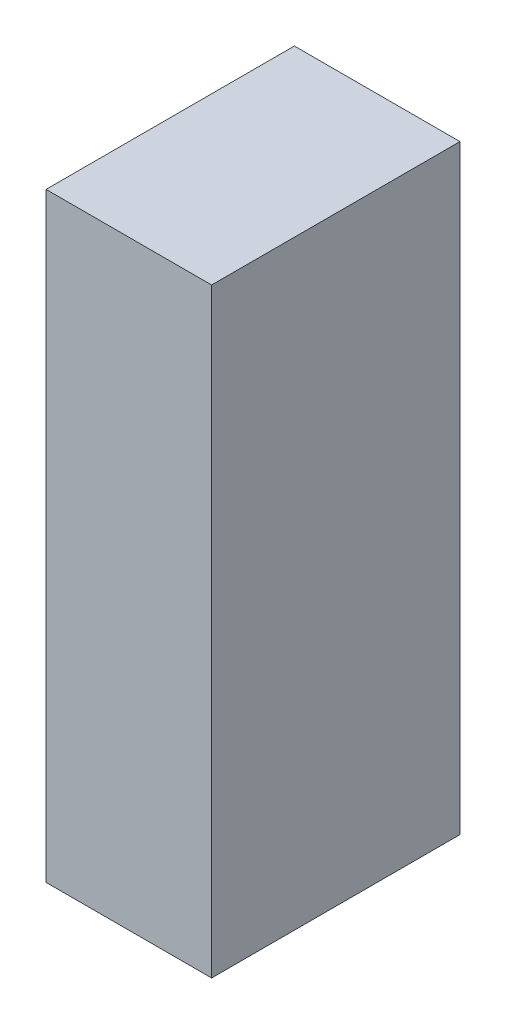
ISO-10303-21;
HEADER;
FILE_DESCRIPTION(('STEP AP214'),'2;1');
FILE_NAME('part.step','',(''),(''),'','','');
FILE_SCHEMA(('AUTOMOTIVE_DESIGN { 1 0 10303 214 1 1 1 1 }'));
ENDSEC;
DATA;
#1=APPLICATION_CONTEXT('core data for automotive mechanical design processes');
#2=APPLICATION_PROTOCOL_DEFINITION('international standard','automotive_design',2000,#1);
#3=PRODUCT_CONTEXT('',#1,'mechanical');
#4=PRODUCT('Part','Part','',(#3));
#5=PRODUCT_RELATED_PRODUCT_CATEGORY('part','',(#4));
#6=PRODUCT_DEFINITION_FORMATION('','',#4);
#7=PRODUCT_DEFINITION_CONTEXT('part definition',#1,'design');
#8=PRODUCT_DEFINITION('design','',#6,#7);
#9=PRODUCT_DEFINITION_SHAPE('','',#8);
#10=(LENGTH_UNIT() NAMED_UNIT(*) SI_UNIT(.MILLI.,.METRE.));
#11=(NAMED_UNIT(*) PLANE_ANGLE_UNIT() SI_UNIT($,.RADIAN.));
#12=(NAMED_UNIT(*) SI_UNIT($,.STERADIAN.) SOLID_ANGLE_UNIT());
#13=UNCERTAINTY_MEASURE_WITH_UNIT(LENGTH_MEASURE(1.E-05),#10,'distance_accuracy_value','');
#14=(GEOMETRIC_REPRESENTATION_CONTEXT(3) GLOBAL_UNCERTAINTY_ASSIGNED_CONTEXT((#13)) GLOBAL_UNIT_ASSIGNED_CONTEXT((#10,
#11,#12)) REPRESENTATION_CONTEXT('',''));
#15=CARTESIAN_POINT('',(0.,0.,0.));
#16=DIRECTION('',(0.,0.,1.));
#17=DIRECTION('',(1.,0.,0.));
#18=AXIS2_PLACEMENT_3D('',#15,#16,#17);
#19=CARTESIAN_POINT('',(-1.09999353711135,0.725001968418042,0.));
#20=DIRECTION('',(-1.,4.37113882867379E-08,0.));
#21=DIRECTION('',(-4.37113882867379E-08,-1.,0.));
#22=AXIS2_PLACEMENT_3D('',#19,#20,#21);
#23=PLANE('',#22);
#24=DIRECTION('',(-4.37113882164523E-08,-0.999999999999999,0.));
#25=VECTOR('',#24,1.);
#26=CARTESIAN_POINT('',(-1.09999353711135,0.725001968418042,0.));
#27=LINE('',#26,#25);
#28=CARTESIAN_POINT('',(-1.09999353711135,0.725001968418042,0.));
#29=VERTEX_POINT('',#28);
#30=CARTESIAN_POINT('',(-1.09999360049339,-0.725010238613209,0.));
#31=VERTEX_POINT('',#30);
#32=EDGE_CURVE('E11',#29,#31,#27,.T.);
#33=ORIENTED_EDGE('',*,*,#32,.T.);
#34=DIRECTION('',(0.,0.,1.));
#35=VECTOR('',#34,1.);
#36=CARTESIAN_POINT('',(-1.09999360049339,-0.725010238613209,0.));
#37=LINE('',#36,#35);
#38=CARTESIAN_POINT('',(-1.09999360049339,-0.725010238613209,0.599998772144318));
#39=VERTEX_POINT('',#38);
#40=EDGE_CURVE('E88',#31,#39,#37,.T.);
#41=ORIENTED_EDGE('',*,*,#40,.T.);
#42=DIRECTION('',(-4.37113882164523E-08,-0.999999999999999,0.));
#43=VECTOR('',#42,1.);
#44=CARTESIAN_POINT('',(-1.09999353711135,0.725001968418042,0.599998772144318));
#45=LINE('',#44,#43);
#46=CARTESIAN_POINT('',(-1.09999353711135,0.725001968418042,0.599998772144318));
#47=VERTEX_POINT('',#46);
#48=EDGE_CURVE('E83',#47,#39,#45,.T.);
#49=ORIENTED_EDGE('',*,*,#48,.F.);
#50=DIRECTION('',(0.,0.,1.));
#51=VECTOR('',#50,1.);
#52=CARTESIAN_POINT('',(-1.09999353711135,0.725001968418033,0.));
#53=LINE('',#52,#51);
#54=EDGE_CURVE('E72',#29,#47,#53,.T.);
#55=ORIENTED_EDGE('',*,*,#54,.F.);
#56=EDGE_LOOP('',(#33,#41,#49,#55));
#57=FACE_BOUND('',#56,.T.);
#58=ADVANCED_FACE('F17',(#57),#23,.T.);
#59=CARTESIAN_POINT('',(-1.09999360049339,-0.725010238613209,0.));
#60=DIRECTION('',(-4.37113882867379E-08,-1.,0.));
#61=DIRECTION('',(1.,-4.37113882867379E-08,0.));
#62=AXIS2_PLACEMENT_3D('',#59,#60,#61);
#63=PLANE('',#62);
#64=DIRECTION('',(0.999999999999999,-4.37113884141336E-08,0.));
#65=VECTOR('',#64,1.);
#66=CARTESIAN_POINT('',(-1.09999360049339,-0.725010238613209,0.));
#67=LINE('',#66,#65);
#68=CARTESIAN_POINT('',(-0.699999704009016,-0.725010256097505,0.));
#69=VERTEX_POINT('',#68);
#70=EDGE_CURVE('E24',#31,#69,#67,.T.);
#71=ORIENTED_EDGE('',*,*,#70,.T.);
#72=DIRECTION('',(0.,0.,1.));
#73=VECTOR('',#72,1.);
#74=CARTESIAN_POINT('',(-0.699999704009016,-0.725010256097497,0.));
#75=LINE('',#74,#73);
#76=CARTESIAN_POINT('',(-0.699999704009016,-0.725010256097505,0.599998772144318));
#77=VERTEX_POINT('',#76);
#78=EDGE_CURVE('E85',#69,#77,#75,.T.);
#79=ORIENTED_EDGE('',*,*,#78,.T.);
#80=DIRECTION('',(0.999999999999999,-4.37113884141336E-08,0.));
#81=VECTOR('',#80,1.);
#82=CARTESIAN_POINT('',(-1.09999360049339,-0.725010238613209,0.599998772144318));
#83=LINE('',#82,#81);
#84=EDGE_CURVE('E66',#39,#77,#83,.T.);
#85=ORIENTED_EDGE('',*,*,#84,.F.);
#86=ORIENTED_EDGE('',*,*,#40,.F.);
#87=EDGE_LOOP('',(#71,#79,#85,#86));
#88=FACE_BOUND('',#87,.T.);
#89=ADVANCED_FACE('F89',(#88),#63,.T.);
#90=CARTESIAN_POINT('',(-0.699999704009016,-0.725010256097505,0.));
#91=DIRECTION('',(1.,-4.37113882867379E-08,0.));
#92=DIRECTION('',(4.37113882867379E-08,1.,0.));
#93=AXIS2_PLACEMENT_3D('',#90,#91,#92);
#94=PLANE('',#93);
#95=DIRECTION('',(4.37113882930187E-08,0.999999999999999,0.));
#96=VECTOR('',#95,1.);
#97=CARTESIAN_POINT('',(-0.699999704009016,-0.725010256097505,0.));
#98=LINE('',#97,#96);
#99=CARTESIAN_POINT('',(-0.69999964062697,0.725001950933745,0.));
#100=VERTEX_POINT('',#99);
#101=EDGE_CURVE('E62',#69,#100,#98,.T.);
#102=ORIENTED_EDGE('',*,*,#101,.T.);
#103=DIRECTION('',(0.,0.,1.));
#104=VECTOR('',#103,1.);
#105=CARTESIAN_POINT('',(-0.69999964062697,0.725001950933745,0.));
#106=LINE('',#105,#104);
#107=CARTESIAN_POINT('',(-0.69999964062697,0.725001950933745,0.599998772144318));
#108=VERTEX_POINT('',#107);
#109=EDGE_CURVE('E55',#100,#108,#106,.T.);
#110=ORIENTED_EDGE('',*,*,#109,.T.);
#111=DIRECTION('',(4.37113882930187E-08,0.999999999999999,0.));
#112=VECTOR('',#111,1.);
#113=CARTESIAN_POINT('',(-0.699999704009016,-0.725010256097505,0.599998772144318));
#114=LINE('',#113,#112);
#115=EDGE_CURVE('E59',#77,#108,#114,.T.);
#116=ORIENTED_EDGE('',*,*,#115,.F.);
#117=ORIENTED_EDGE('',*,*,#78,.F.);
#118=EDGE_LOOP('',(#102,#110,#116,#117));
#119=FACE_BOUND('',#118,.T.);
#120=ADVANCED_FACE('F57',(#119),#94,.T.);
#121=CARTESIAN_POINT('',(-0.69999964062697,0.725001950933745,0.));
#122=DIRECTION('',(4.37113882867379E-08,1.,0.));
#123=DIRECTION('',(-1.,4.37113882867379E-08,0.));
#124=AXIS2_PLACEMENT_3D('',#121,#122,#123);
#125=PLANE('',#124);
#126=DIRECTION('',(-0.999999999999999,4.37113884141336E-08,0.));
#127=VECTOR('',#126,1.);
#128=CARTESIAN_POINT('',(-0.69999964062697,0.725001950933745,0.));
#129=LINE('',#128,#127);
#130=EDGE_CURVE('E65',#100,#29,#129,.T.);
#131=ORIENTED_EDGE('',*,*,#130,.T.);
#132=ORIENTED_EDGE('',*,*,#54,.T.);
#133=DIRECTION('',(-0.999999999999999,4.37113884141336E-08,0.));
#134=VECTOR('',#133,1.);
#135=CARTESIAN_POINT('',(-0.69999964062697,0.725001950933745,0.599998772144318));
#136=LINE('',#135,#134);
#137=EDGE_CURVE('E70',#108,#47,#136,.T.);
#138=ORIENTED_EDGE('',*,*,#137,.F.);
#139=ORIENTED_EDGE('',*,*,#109,.F.);
#140=EDGE_LOOP('',(#131,#132,#138,#139));
#141=FACE_BOUND('',#140,.T.);
#142=ADVANCED_FACE('F71',(#141),#125,.T.);
#143=CARTESIAN_POINT('',(-95.6999816894531,411.399993896484,0.599998772144318));
#144=DIRECTION('',(0.,0.,1.));
#145=DIRECTION('',(-4.37113882867379E-08,-1.,0.));
#146=AXIS2_PLACEMENT_3D('',#143,#144,#145);
#147=PLANE('',#146);
#148=ORIENTED_EDGE('',*,*,#48,.T.);
#149=ORIENTED_EDGE('',*,*,#84,.T.);
#150=ORIENTED_EDGE('',*,*,#115,.T.);
#151=ORIENTED_EDGE('',*,*,#137,.T.);
#152=EDGE_LOOP('',(#148,#149,#150,#151));
#153=FACE_BOUND('',#152,.T.);
#154=ADVANCED_FACE('F76',(#153),#147,.T.);
#155=CARTESIAN_POINT('',(-95.6999816894531,411.399993896484,0.));
#156=DIRECTION('',(0.,0.,1.));
#157=DIRECTION('',(-4.37113882867379E-08,-1.,0.));
#158=AXIS2_PLACEMENT_3D('',#155,#156,#157);
#159=PLANE('',#158);
#160=ORIENTED_EDGE('',*,*,#130,.F.);
#161=ORIENTED_EDGE('',*,*,#101,.F.);
#162=ORIENTED_EDGE('',*,*,#70,.F.);
#163=ORIENTED_EDGE('',*,*,#32,.F.);
#164=EDGE_LOOP('',(#160,#161,#162,#163));
#165=FACE_BOUND('',#164,.T.);
#166=ADVANCED_FACE('F91',(#165),#159,.F.);
#167=CLOSED_SHELL('',(#58,#89,#120,#142,#154,#166));
#168=MANIFOLD_SOLID_BREP('B1',#167);
#169=ADVANCED_BREP_SHAPE_REPRESENTATION('',(#18,#168),#14);
#170=SHAPE_DEFINITION_REPRESENTATION(#9,#169);
ENDSEC;
END-ISO-10303-21;
